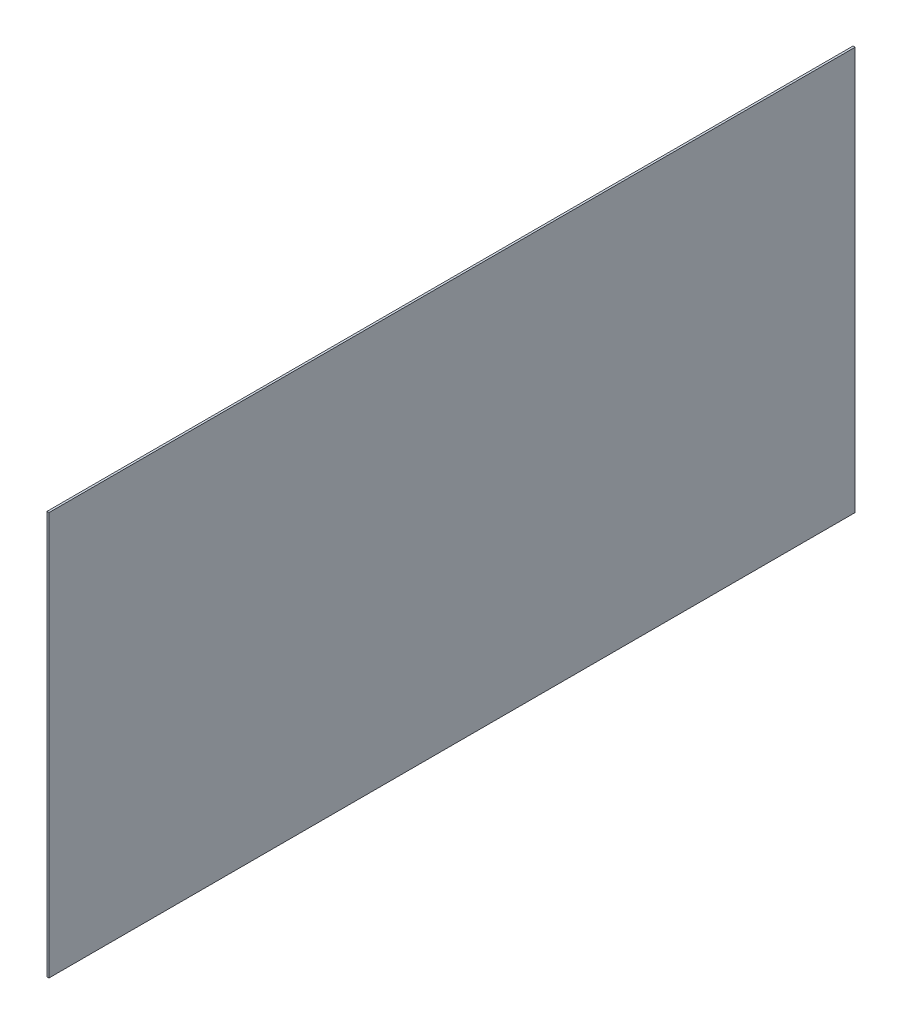
ISO-10303-21;
HEADER;
FILE_DESCRIPTION(('STEP AP214'),'2;1');
FILE_NAME('part.step','',(''),(''),'','','');
FILE_SCHEMA(('AUTOMOTIVE_DESIGN { 1 0 10303 214 1 1 1 1 }'));
ENDSEC;
DATA;
#1=APPLICATION_CONTEXT('core data for automotive mechanical design processes');
#2=APPLICATION_PROTOCOL_DEFINITION('international standard','automotive_design',2000,#1);
#3=PRODUCT_CONTEXT('',#1,'mechanical');
#4=PRODUCT('Part','Part','',(#3));
#5=PRODUCT_RELATED_PRODUCT_CATEGORY('part','',(#4));
#6=PRODUCT_DEFINITION_FORMATION('','',#4);
#7=PRODUCT_DEFINITION_CONTEXT('part definition',#1,'design');
#8=PRODUCT_DEFINITION('design','',#6,#7);
#9=PRODUCT_DEFINITION_SHAPE('','',#8);
#10=(LENGTH_UNIT() NAMED_UNIT(*) SI_UNIT(.MILLI.,.METRE.));
#11=(NAMED_UNIT(*) PLANE_ANGLE_UNIT() SI_UNIT($,.RADIAN.));
#12=(NAMED_UNIT(*) SI_UNIT($,.STERADIAN.) SOLID_ANGLE_UNIT());
#13=UNCERTAINTY_MEASURE_WITH_UNIT(LENGTH_MEASURE(1.E-05),#10,'distance_accuracy_value','');
#14=(GEOMETRIC_REPRESENTATION_CONTEXT(3) GLOBAL_UNCERTAINTY_ASSIGNED_CONTEXT((#13)) GLOBAL_UNIT_ASSIGNED_CONTEXT((#10,
#11,#12)) REPRESENTATION_CONTEXT('',''));
#15=CARTESIAN_POINT('',(0.,0.,0.));
#16=DIRECTION('',(0.,0.,1.));
#17=DIRECTION('',(1.,0.,0.));
#18=AXIS2_PLACEMENT_3D('',#15,#16,#17);
#19=CARTESIAN_POINT('',(4.7625,0.,0.));
#20=DIRECTION('',(0.,0.,-1.));
#21=DIRECTION('',(-1.,0.,0.));
#22=AXIS2_PLACEMENT_3D('',#19,#20,#21);
#23=PLANE('',#22);
#24=DIRECTION('',(0.,-1.,0.));
#25=VECTOR('',#24,1.);
#26=CARTESIAN_POINT('',(0.,0.,0.));
#27=LINE('',#26,#25);
#28=CARTESIAN_POINT('',(0.,914.4,0.));
#29=VERTEX_POINT('',#28);
#30=CARTESIAN_POINT('',(0.,0.,0.));
#31=VERTEX_POINT('',#30);
#32=EDGE_CURVE('E98',#29,#31,#27,.T.);
#33=ORIENTED_EDGE('',*,*,#32,.T.);
#34=DIRECTION('',(-1.,0.,0.));
#35=VECTOR('',#34,1.);
#36=CARTESIAN_POINT('',(4.7625,0.,0.));
#37=LINE('',#36,#35);
#38=CARTESIAN_POINT('',(4.7625,0.,0.));
#39=VERTEX_POINT('',#38);
#40=EDGE_CURVE('E11',#39,#31,#37,.T.);
#41=ORIENTED_EDGE('',*,*,#40,.F.);
#42=DIRECTION('',(0.,-1.,0.));
#43=VECTOR('',#42,1.);
#44=CARTESIAN_POINT('',(4.7625,0.,0.));
#45=LINE('',#44,#43);
#46=CARTESIAN_POINT('',(4.7625,914.4,0.));
#47=VERTEX_POINT('',#46);
#48=EDGE_CURVE('E86',#47,#39,#45,.T.);
#49=ORIENTED_EDGE('',*,*,#48,.F.);
#50=DIRECTION('',(-1.,0.,0.));
#51=VECTOR('',#50,1.);
#52=CARTESIAN_POINT('',(4.7625,914.4,0.));
#53=LINE('',#52,#51);
#54=EDGE_CURVE('E94',#47,#29,#53,.T.);
#55=ORIENTED_EDGE('',*,*,#54,.T.);
#56=EDGE_LOOP('',(#33,#41,#49,#55));
#57=FACE_BOUND('',#56,.T.);
#58=ADVANCED_FACE('F35',(#57),#23,.F.);
#59=CARTESIAN_POINT('',(4.7625,0.,0.));
#60=DIRECTION('',(0.,1.,0.));
#61=DIRECTION('',(0.,0.,1.));
#62=AXIS2_PLACEMENT_3D('',#59,#60,#61);
#63=PLANE('',#62);
#64=DIRECTION('',(0.,0.,-1.));
#65=VECTOR('',#64,1.);
#66=CARTESIAN_POINT('',(0.,0.,0.));
#67=LINE('',#66,#65);
#68=CARTESIAN_POINT('',(0.,0.,-1828.8));
#69=VERTEX_POINT('',#68);
#70=EDGE_CURVE('E90',#31,#69,#67,.T.);
#71=ORIENTED_EDGE('',*,*,#70,.T.);
#72=DIRECTION('',(-1.,0.,0.));
#73=VECTOR('',#72,1.);
#74=CARTESIAN_POINT('',(4.7625,0.,-1828.8));
#75=LINE('',#74,#73);
#76=CARTESIAN_POINT('',(4.7625,0.,-1828.8));
#77=VERTEX_POINT('',#76);
#78=EDGE_CURVE('E43',#77,#69,#75,.T.);
#79=ORIENTED_EDGE('',*,*,#78,.F.);
#80=DIRECTION('',(0.,0.,-1.));
#81=VECTOR('',#80,1.);
#82=CARTESIAN_POINT('',(4.7625,0.,0.));
#83=LINE('',#82,#81);
#84=EDGE_CURVE('E81',#39,#77,#83,.T.);
#85=ORIENTED_EDGE('',*,*,#84,.F.);
#86=ORIENTED_EDGE('',*,*,#40,.T.);
#87=EDGE_LOOP('',(#71,#79,#85,#86));
#88=FACE_BOUND('',#87,.T.);
#89=ADVANCED_FACE('F89',(#88),#63,.F.);
#90=CARTESIAN_POINT('',(4.7625,0.,-1828.8));
#91=DIRECTION('',(0.,0.,1.));
#92=DIRECTION('',(1.,0.,0.));
#93=AXIS2_PLACEMENT_3D('',#90,#91,#92);
#94=PLANE('',#93);
#95=DIRECTION('',(0.,1.,0.));
#96=VECTOR('',#95,1.);
#97=CARTESIAN_POINT('',(0.,0.,-1828.8));
#98=LINE('',#97,#96);
#99=CARTESIAN_POINT('',(0.,914.4,-1828.8));
#100=VERTEX_POINT('',#99);
#101=EDGE_CURVE('E68',#69,#100,#98,.T.);
#102=ORIENTED_EDGE('',*,*,#101,.T.);
#103=DIRECTION('',(-1.,0.,0.));
#104=VECTOR('',#103,1.);
#105=CARTESIAN_POINT('',(4.7625,914.4,-1828.8));
#106=LINE('',#105,#104);
#107=CARTESIAN_POINT('',(4.7625,914.4,-1828.8));
#108=VERTEX_POINT('',#107);
#109=EDGE_CURVE('E91',#108,#100,#106,.T.);
#110=ORIENTED_EDGE('',*,*,#109,.F.);
#111=DIRECTION('',(0.,1.,0.));
#112=VECTOR('',#111,1.);
#113=CARTESIAN_POINT('',(4.7625,0.,-1828.8));
#114=LINE('',#113,#112);
#115=EDGE_CURVE('E84',#77,#108,#114,.T.);
#116=ORIENTED_EDGE('',*,*,#115,.F.);
#117=ORIENTED_EDGE('',*,*,#78,.T.);
#118=EDGE_LOOP('',(#102,#110,#116,#117));
#119=FACE_BOUND('',#118,.T.);
#120=ADVANCED_FACE('F92',(#119),#94,.F.);
#121=CARTESIAN_POINT('',(4.7625,914.4,0.));
#122=DIRECTION('',(0.,-1.,0.));
#123=DIRECTION('',(0.,0.,-1.));
#124=AXIS2_PLACEMENT_3D('',#121,#122,#123);
#125=PLANE('',#124);
#126=DIRECTION('',(0.,0.,1.));
#127=VECTOR('',#126,1.);
#128=CARTESIAN_POINT('',(0.,914.4,0.));
#129=LINE('',#128,#127);
#130=EDGE_CURVE('E74',#100,#29,#129,.T.);
#131=ORIENTED_EDGE('',*,*,#130,.T.);
#132=ORIENTED_EDGE('',*,*,#54,.F.);
#133=DIRECTION('',(0.,0.,1.));
#134=VECTOR('',#133,1.);
#135=CARTESIAN_POINT('',(4.7625,914.4,0.));
#136=LINE('',#135,#134);
#137=EDGE_CURVE('E51',#108,#47,#136,.T.);
#138=ORIENTED_EDGE('',*,*,#137,.F.);
#139=ORIENTED_EDGE('',*,*,#109,.T.);
#140=EDGE_LOOP('',(#131,#132,#138,#139));
#141=FACE_BOUND('',#140,.T.);
#142=ADVANCED_FACE('F105',(#141),#125,.F.);
#143=CARTESIAN_POINT('',(4.7625,0.,0.));
#144=DIRECTION('',(-1.,0.,0.));
#145=DIRECTION('',(0.,0.,1.));
#146=AXIS2_PLACEMENT_3D('',#143,#144,#145);
#147=PLANE('',#146);
#148=ORIENTED_EDGE('',*,*,#48,.T.);
#149=ORIENTED_EDGE('',*,*,#84,.T.);
#150=ORIENTED_EDGE('',*,*,#115,.T.);
#151=ORIENTED_EDGE('',*,*,#137,.T.);
#152=EDGE_LOOP('',(#148,#149,#150,#151));
#153=FACE_BOUND('',#152,.T.);
#154=ADVANCED_FACE('F82',(#153),#147,.F.);
#155=CARTESIAN_POINT('',(0.,0.,0.));
#156=DIRECTION('',(-1.,0.,0.));
#157=DIRECTION('',(0.,0.,1.));
#158=AXIS2_PLACEMENT_3D('',#155,#156,#157);
#159=PLANE('',#158);
#160=ORIENTED_EDGE('',*,*,#32,.F.);
#161=ORIENTED_EDGE('',*,*,#130,.F.);
#162=ORIENTED_EDGE('',*,*,#101,.F.);
#163=ORIENTED_EDGE('',*,*,#70,.F.);
#164=EDGE_LOOP('',(#160,#161,#162,#163));
#165=FACE_BOUND('',#164,.T.);
#166=ADVANCED_FACE('F108',(#165),#159,.T.);
#167=CLOSED_SHELL('',(#58,#89,#120,#142,#154,#166));
#168=MANIFOLD_SOLID_BREP('B2',#167);
#169=ADVANCED_BREP_SHAPE_REPRESENTATION('',(#18,#168),#14);
#170=SHAPE_DEFINITION_REPRESENTATION(#9,#169);
ENDSEC;
END-ISO-10303-21;
